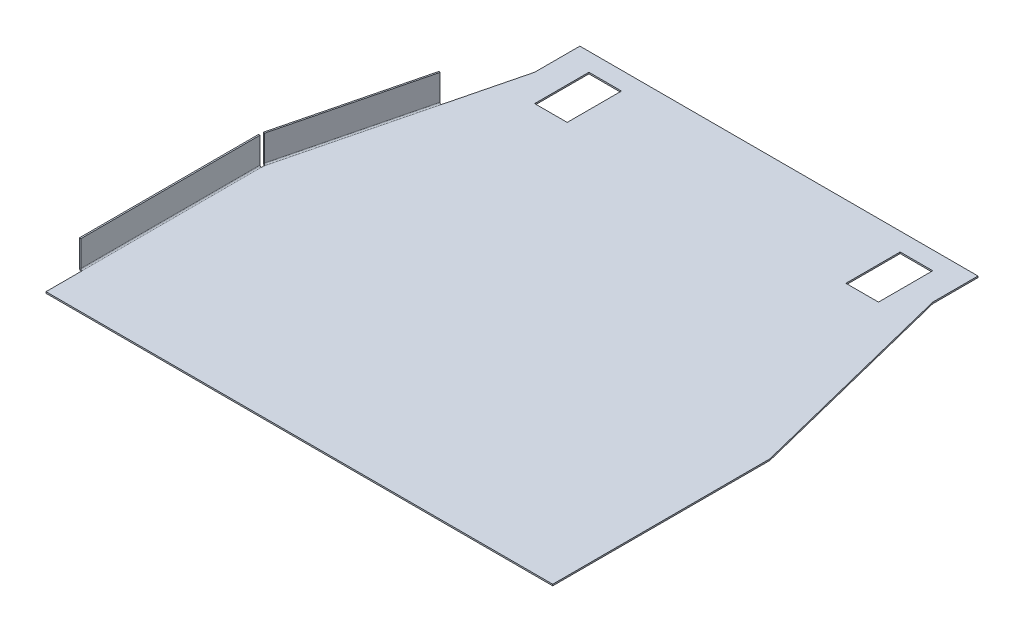
ISO-10303-21;
HEADER;
FILE_DESCRIPTION(('STEP AP214'),'2;1');
FILE_NAME('part.step','',(''),(''),'','','');
FILE_SCHEMA(('AUTOMOTIVE_DESIGN { 1 0 10303 214 1 1 1 1 }'));
ENDSEC;
DATA;
#1=APPLICATION_CONTEXT('core data for automotive mechanical design processes');
#2=APPLICATION_PROTOCOL_DEFINITION('international standard','automotive_design',2000,#1);
#3=PRODUCT_CONTEXT('',#1,'mechanical');
#4=PRODUCT('Part','Part','',(#3));
#5=PRODUCT_RELATED_PRODUCT_CATEGORY('part','',(#4));
#6=PRODUCT_DEFINITION_FORMATION('','',#4);
#7=PRODUCT_DEFINITION_CONTEXT('part definition',#1,'design');
#8=PRODUCT_DEFINITION('design','',#6,#7);
#9=PRODUCT_DEFINITION_SHAPE('','',#8);
#10=(LENGTH_UNIT() NAMED_UNIT(*) SI_UNIT(.MILLI.,.METRE.));
#11=(NAMED_UNIT(*) PLANE_ANGLE_UNIT() SI_UNIT($,.RADIAN.));
#12=(NAMED_UNIT(*) SI_UNIT($,.STERADIAN.) SOLID_ANGLE_UNIT());
#13=UNCERTAINTY_MEASURE_WITH_UNIT(LENGTH_MEASURE(1.E-05),#10,'distance_accuracy_value','');
#14=(GEOMETRIC_REPRESENTATION_CONTEXT(3) GLOBAL_UNCERTAINTY_ASSIGNED_CONTEXT((#13)) GLOBAL_UNIT_ASSIGNED_CONTEXT((#10,
#11,#12)) REPRESENTATION_CONTEXT('',''));
#15=CARTESIAN_POINT('',(0.,0.,0.));
#16=DIRECTION('',(0.,0.,1.));
#17=DIRECTION('',(1.,0.,0.));
#18=AXIS2_PLACEMENT_3D('',#15,#16,#17);
#19=CARTESIAN_POINT('',(-140.,-0.8,-60.));
#20=DIRECTION('',(-0.970142500145332,0.,-0.242535625036333));
#21=DIRECTION('',(-0.242535625036333,0.,0.970142500145332));
#22=AXIS2_PLACEMENT_3D('',#19,#20,#21);
#23=PLANE('',#22);
#24=DIRECTION('',(-0.242535625036333,0.,0.970142500145332));
#25=VECTOR('',#24,1.);
#26=CARTESIAN_POINT('',(-140.,0.,-60.));
#27=LINE('',#26,#25);
#28=CARTESIAN_POINT('',(-139.757464374964,-3.89553840574042E-13,-60.9701425001453));
#29=VERTEX_POINT('',#28);
#30=CARTESIAN_POINT('',(-140.,0.,-60.));
#31=VERTEX_POINT('',#30);
#32=EDGE_CURVE('E365',#29,#31,#27,.T.);
#33=ORIENTED_EDGE('',*,*,#32,.F.);
#34=DIRECTION('',(5.275292677418E-13,-1.,1.31882316935456E-13));
#35=VECTOR('',#34,1.);
#36=CARTESIAN_POINT('',(-139.757464374964,-3.89553840574042E-13,-60.9701425001453));
#37=LINE('',#36,#35);
#38=CARTESIAN_POINT('',(-139.757464374964,-0.8,-60.9701425001453));
#39=VERTEX_POINT('',#38);
#40=EDGE_CURVE('E311',#29,#39,#37,.T.);
#41=ORIENTED_EDGE('',*,*,#40,.T.);
#42=DIRECTION('',(-0.242535625036333,0.,0.970142500145332));
#43=VECTOR('',#42,1.);
#44=CARTESIAN_POINT('',(-140.,-0.8,-60.));
#45=LINE('',#44,#43);
#46=CARTESIAN_POINT('',(-140.,-0.8,-60.));
#47=VERTEX_POINT('',#46);
#48=EDGE_CURVE('E543',#39,#47,#45,.T.);
#49=ORIENTED_EDGE('',*,*,#48,.T.);
#50=DIRECTION('',(0.,1.,0.));
#51=VECTOR('',#50,1.);
#52=CARTESIAN_POINT('',(-140.,-0.8,-60.));
#53=LINE('',#52,#51);
#54=EDGE_CURVE('E418',#47,#31,#53,.T.);
#55=ORIENTED_EDGE('',*,*,#54,.T.);
#56=EDGE_LOOP('',(#33,#41,#49,#55));
#57=FACE_BOUND('',#56,.T.);
#58=ADVANCED_FACE('F75',(#57),#23,.T.);
#59=CARTESIAN_POINT('',(-140.,-0.8,-60.));
#60=DIRECTION('',(-1.,0.,0.));
#61=DIRECTION('',(0.,0.,1.));
#62=AXIS2_PLACEMENT_3D('',#59,#60,#61);
#63=PLANE('',#62);
#64=DIRECTION('',(0.,0.,1.));
#65=VECTOR('',#64,1.);
#66=CARTESIAN_POINT('',(-140.,0.,-60.));
#67=LINE('',#66,#65);
#68=CARTESIAN_POINT('',(-140.,0.,40.));
#69=VERTEX_POINT('',#68);
#70=CARTESIAN_POINT('',(-140.,0.,60.));
#71=VERTEX_POINT('',#70);
#72=EDGE_CURVE('E406',#69,#71,#67,.T.);
#73=ORIENTED_EDGE('',*,*,#72,.F.);
#74=DIRECTION('',(0.,-1.,0.));
#75=VECTOR('',#74,1.);
#76=CARTESIAN_POINT('',(-140.,0.,40.));
#77=LINE('',#76,#75);
#78=CARTESIAN_POINT('',(-140.,-0.8,40.));
#79=VERTEX_POINT('',#78);
#80=EDGE_CURVE('E450',#69,#79,#77,.T.);
#81=ORIENTED_EDGE('',*,*,#80,.T.);
#82=DIRECTION('',(0.,0.,1.));
#83=VECTOR('',#82,1.);
#84=CARTESIAN_POINT('',(-140.,-0.8,-60.));
#85=LINE('',#84,#83);
#86=CARTESIAN_POINT('',(-140.,-0.8,60.));
#87=VERTEX_POINT('',#86);
#88=EDGE_CURVE('E393',#79,#87,#85,.T.);
#89=ORIENTED_EDGE('',*,*,#88,.T.);
#90=DIRECTION('',(0.,1.,0.));
#91=VECTOR('',#90,1.);
#92=CARTESIAN_POINT('',(-140.,-0.8,60.));
#93=LINE('',#92,#91);
#94=EDGE_CURVE('E84',#87,#71,#93,.T.);
#95=ORIENTED_EDGE('',*,*,#94,.T.);
#96=EDGE_LOOP('',(#73,#81,#89,#95));
#97=FACE_BOUND('',#96,.T.);
#98=ADVANCED_FACE('F449',(#97),#63,.T.);
#99=CARTESIAN_POINT('',(140.,-0.8,-60.));
#100=DIRECTION('',(1.,0.,0.));
#101=DIRECTION('',(0.,0.,-1.));
#102=AXIS2_PLACEMENT_3D('',#99,#100,#101);
#103=PLANE('',#102);
#104=DIRECTION('',(0.,0.,-1.));
#105=VECTOR('',#104,1.);
#106=CARTESIAN_POINT('',(140.,0.,-60.));
#107=LINE('',#106,#105);
#108=CARTESIAN_POINT('',(140.,0.,60.));
#109=VERTEX_POINT('',#108);
#110=CARTESIAN_POINT('',(140.,0.,-60.));
#111=VERTEX_POINT('',#110);
#112=EDGE_CURVE('E383',#109,#111,#107,.T.);
#113=ORIENTED_EDGE('',*,*,#112,.F.);
#114=DIRECTION('',(0.,1.,0.));
#115=VECTOR('',#114,1.);
#116=CARTESIAN_POINT('',(140.,-0.8,60.));
#117=LINE('',#116,#115);
#118=CARTESIAN_POINT('',(140.,-0.8,60.));
#119=VERTEX_POINT('',#118);
#120=EDGE_CURVE('E13',#119,#109,#117,.T.);
#121=ORIENTED_EDGE('',*,*,#120,.F.);
#122=DIRECTION('',(0.,0.,-1.));
#123=VECTOR('',#122,1.);
#124=CARTESIAN_POINT('',(140.,-0.8,-60.));
#125=LINE('',#124,#123);
#126=CARTESIAN_POINT('',(140.,-0.8,-60.));
#127=VERTEX_POINT('',#126);
#128=EDGE_CURVE('E391',#119,#127,#125,.T.);
#129=ORIENTED_EDGE('',*,*,#128,.T.);
#130=DIRECTION('',(0.,1.,0.));
#131=VECTOR('',#130,1.);
#132=CARTESIAN_POINT('',(140.,-0.8,-60.));
#133=LINE('',#132,#131);
#134=EDGE_CURVE('E420',#127,#111,#133,.T.);
#135=ORIENTED_EDGE('',*,*,#134,.T.);
#136=EDGE_LOOP('',(#113,#121,#129,#135));
#137=FACE_BOUND('',#136,.T.);
#138=ADVANCED_FACE('F77',(#137),#103,.T.);
#139=CARTESIAN_POINT('',(-140.,-0.8,60.));
#140=DIRECTION('',(0.,0.,1.));
#141=DIRECTION('',(1.,0.,0.));
#142=AXIS2_PLACEMENT_3D('',#139,#140,#141);
#143=PLANE('',#142);
#144=DIRECTION('',(1.,0.,0.));
#145=VECTOR('',#144,1.);
#146=CARTESIAN_POINT('',(-140.,0.,60.));
#147=LINE('',#146,#145);
#148=EDGE_CURVE('E394',#71,#109,#147,.T.);
#149=ORIENTED_EDGE('',*,*,#148,.F.);
#150=ORIENTED_EDGE('',*,*,#94,.F.);
#151=DIRECTION('',(1.,0.,0.));
#152=VECTOR('',#151,1.);
#153=CARTESIAN_POINT('',(-140.,-0.8,60.));
#154=LINE('',#153,#152);
#155=EDGE_CURVE('E397',#87,#119,#154,.T.);
#156=ORIENTED_EDGE('',*,*,#155,.T.);
#157=ORIENTED_EDGE('',*,*,#120,.T.);
#158=EDGE_LOOP('',(#149,#150,#156,#157));
#159=FACE_BOUND('',#158,.T.);
#160=ADVANCED_FACE('F429',(#159),#143,.T.);
#161=DIRECTION('',(0.,-1.,0.));
#162=VECTOR('',#161,1.);
#163=CARTESIAN_POINT('',(-140.,0.,-59.));
#164=LINE('',#163,#162);
#165=CARTESIAN_POINT('',(-140.,0.,-59.));
#166=VERTEX_POINT('',#165);
#167=CARTESIAN_POINT('',(-140.,-0.799999999999997,-59.));
#168=VERTEX_POINT('',#167);
#169=EDGE_CURVE('E453',#166,#168,#164,.T.);
#170=ORIENTED_EDGE('',*,*,#169,.F.);
#171=EDGE_CURVE('E409',#31,#166,#67,.T.);
#172=ORIENTED_EDGE('',*,*,#171,.F.);
#173=ORIENTED_EDGE('',*,*,#54,.F.);
#174=EDGE_CURVE('E403',#47,#168,#85,.T.);
#175=ORIENTED_EDGE('',*,*,#174,.T.);
#176=EDGE_LOOP('',(#170,#172,#173,#175));
#177=FACE_BOUND('',#176,.T.);
#178=ADVANCED_FACE('F555',(#177),#63,.T.);
#179=CARTESIAN_POINT('',(0.,-0.8,0.));
#180=DIRECTION('',(0.,1.,0.));
#181=DIRECTION('',(0.,0.,1.));
#182=AXIS2_PLACEMENT_3D('',#179,#180,#181);
#183=PLANE('',#182);
#184=DIRECTION('',(1.,0.,0.));
#185=VECTOR('',#184,1.);
#186=CARTESIAN_POINT('',(95.,-0.8,-165.));
#187=LINE('',#186,#185);
#188=CARTESIAN_POINT('',(77.,-0.8,-165.));
#189=VERTEX_POINT('',#188);
#190=CARTESIAN_POINT('',(95.,-0.8,-165.));
#191=VERTEX_POINT('',#190);
#192=EDGE_CURVE('E482',#189,#191,#187,.T.);
#193=ORIENTED_EDGE('',*,*,#192,.T.);
#194=DIRECTION('',(0.,0.,-1.));
#195=VECTOR('',#194,1.);
#196=CARTESIAN_POINT('',(95.,-0.8,-165.));
#197=LINE('',#196,#195);
#198=CARTESIAN_POINT('',(95.,-0.8,-195.));
#199=VERTEX_POINT('',#198);
#200=EDGE_CURVE('E472',#191,#199,#197,.T.);
#201=ORIENTED_EDGE('',*,*,#200,.T.);
#202=DIRECTION('',(-1.,0.,0.));
#203=VECTOR('',#202,1.);
#204=CARTESIAN_POINT('',(95.,-0.8,-195.));
#205=LINE('',#204,#203);
#206=CARTESIAN_POINT('',(77.,-0.8,-195.));
#207=VERTEX_POINT('',#206);
#208=EDGE_CURVE('E475',#199,#207,#205,.T.);
#209=ORIENTED_EDGE('',*,*,#208,.T.);
#210=DIRECTION('',(0.,0.,1.));
#211=VECTOR('',#210,1.);
#212=CARTESIAN_POINT('',(77.,-0.8,-165.));
#213=LINE('',#212,#211);
#214=EDGE_CURVE('E479',#207,#189,#213,.T.);
#215=ORIENTED_EDGE('',*,*,#214,.T.);
#216=EDGE_LOOP('',(#193,#201,#209,#215));
#217=FACE_BOUND('',#216,.T.);
#218=DIRECTION('',(1.,0.,0.));
#219=VECTOR('',#218,1.);
#220=CARTESIAN_POINT('',(-95.,-0.8,-165.));
#221=LINE('',#220,#219);
#222=CARTESIAN_POINT('',(-95.,-0.8,-165.));
#223=VERTEX_POINT('',#222);
#224=CARTESIAN_POINT('',(-77.,-0.8,-165.));
#225=VERTEX_POINT('',#224);
#226=EDGE_CURVE('E514',#223,#225,#221,.T.);
#227=ORIENTED_EDGE('',*,*,#226,.T.);
#228=DIRECTION('',(0.,0.,-1.));
#229=VECTOR('',#228,1.);
#230=CARTESIAN_POINT('',(-77.,-0.8,-165.));
#231=LINE('',#230,#229);
#232=CARTESIAN_POINT('',(-77.,-0.8,-195.));
#233=VERTEX_POINT('',#232);
#234=EDGE_CURVE('E504',#225,#233,#231,.T.);
#235=ORIENTED_EDGE('',*,*,#234,.T.);
#236=DIRECTION('',(-1.,0.,0.));
#237=VECTOR('',#236,1.);
#238=CARTESIAN_POINT('',(-95.,-0.8,-195.));
#239=LINE('',#238,#237);
#240=CARTESIAN_POINT('',(-95.,-0.8,-195.));
#241=VERTEX_POINT('',#240);
#242=EDGE_CURVE('E507',#233,#241,#239,.T.);
#243=ORIENTED_EDGE('',*,*,#242,.T.);
#244=DIRECTION('',(0.,0.,1.));
#245=VECTOR('',#244,1.);
#246=CARTESIAN_POINT('',(-95.,-0.8,-165.));
#247=LINE('',#246,#245);
#248=EDGE_CURVE('E511',#241,#223,#247,.T.);
#249=ORIENTED_EDGE('',*,*,#248,.T.);
#250=EDGE_LOOP('',(#227,#235,#243,#249));
#251=FACE_BOUND('',#250,.T.);
#252=ORIENTED_EDGE('',*,*,#128,.F.);
#253=ORIENTED_EDGE('',*,*,#155,.F.);
#254=ORIENTED_EDGE('',*,*,#88,.F.);
#255=DIRECTION('',(0.,0.,1.));
#256=VECTOR('',#255,1.);
#257=CARTESIAN_POINT('',(-140.,-0.799999999999997,40.));
#258=LINE('',#257,#256);
#259=EDGE_CURVE('E459',#79,#168,#258,.F.);
#260=ORIENTED_EDGE('',*,*,#259,.T.);
#261=ORIENTED_EDGE('',*,*,#174,.F.);
#262=ORIENTED_EDGE('',*,*,#48,.F.);
#263=DIRECTION('',(-0.242535625036343,0.,0.970142500145329));
#264=VECTOR('',#263,1.);
#265=CARTESIAN_POINT('',(-139.757464374963,-0.80000000000039,-60.9701425001452));
#266=LINE('',#265,#264);
#267=CARTESIAN_POINT('',(-120.354614372056,-0.80000000000039,-138.581542511772));
#268=VERTEX_POINT('',#267);
#269=EDGE_CURVE('E321',#39,#268,#266,.F.);
#270=ORIENTED_EDGE('',*,*,#269,.T.);
#271=CARTESIAN_POINT('',(-110.,-0.8,-180.));
#272=VERTEX_POINT('',#271);
#273=EDGE_CURVE('E358',#272,#268,#45,.T.);
#274=ORIENTED_EDGE('',*,*,#273,.F.);
#275=DIRECTION('',(0.,0.,1.));
#276=VECTOR('',#275,1.);
#277=CARTESIAN_POINT('',(-110.,-0.8,-180.));
#278=LINE('',#277,#276);
#279=CARTESIAN_POINT('',(-110.,-0.8,-205.));
#280=VERTEX_POINT('',#279);
#281=EDGE_CURVE('E540',#280,#272,#278,.T.);
#282=ORIENTED_EDGE('',*,*,#281,.F.);
#283=DIRECTION('',(-1.,0.,0.));
#284=VECTOR('',#283,1.);
#285=CARTESIAN_POINT('',(-110.,-0.8,-205.));
#286=LINE('',#285,#284);
#287=CARTESIAN_POINT('',(110.,-0.8,-205.));
#288=VERTEX_POINT('',#287);
#289=EDGE_CURVE('E537',#288,#280,#286,.T.);
#290=ORIENTED_EDGE('',*,*,#289,.F.);
#291=DIRECTION('',(0.,0.,-1.));
#292=VECTOR('',#291,1.);
#293=CARTESIAN_POINT('',(110.,-0.8,-180.));
#294=LINE('',#293,#292);
#295=CARTESIAN_POINT('',(110.,-0.8,-180.));
#296=VERTEX_POINT('',#295);
#297=EDGE_CURVE('E368',#296,#288,#294,.T.);
#298=ORIENTED_EDGE('',*,*,#297,.F.);
#299=DIRECTION('',(-0.242535625036333,0.,-0.970142500145332));
#300=VECTOR('',#299,1.);
#301=CARTESIAN_POINT('',(140.,-0.8,-60.));
#302=LINE('',#301,#300);
#303=EDGE_CURVE('E390',#127,#296,#302,.T.);
#304=ORIENTED_EDGE('',*,*,#303,.F.);
#305=EDGE_LOOP('',(#252,#253,#254,#260,#261,#262,#270,#274,#282,#290,#298,#304));
#306=FACE_BOUND('',#305,.T.);
#307=ADVANCED_FACE('F432',(#217,#251,#306),#183,.F.);
#308=CARTESIAN_POINT('',(0.,0.,0.));
#309=DIRECTION('',(0.,1.,0.));
#310=DIRECTION('',(0.,0.,1.));
#311=AXIS2_PLACEMENT_3D('',#308,#309,#310);
#312=PLANE('',#311);
#313=DIRECTION('',(0.,0.,-1.));
#314=VECTOR('',#313,1.);
#315=CARTESIAN_POINT('',(95.,0.,-165.));
#316=LINE('',#315,#314);
#317=CARTESIAN_POINT('',(95.,0.,-165.));
#318=VERTEX_POINT('',#317);
#319=CARTESIAN_POINT('',(95.,0.,-195.));
#320=VERTEX_POINT('',#319);
#321=EDGE_CURVE('E456',#318,#320,#316,.T.);
#322=ORIENTED_EDGE('',*,*,#321,.F.);
#323=DIRECTION('',(1.,0.,0.));
#324=VECTOR('',#323,1.);
#325=CARTESIAN_POINT('',(95.,0.,-165.));
#326=LINE('',#325,#324);
#327=CARTESIAN_POINT('',(77.,0.,-165.));
#328=VERTEX_POINT('',#327);
#329=EDGE_CURVE('E476',#328,#318,#326,.T.);
#330=ORIENTED_EDGE('',*,*,#329,.F.);
#331=DIRECTION('',(0.,0.,1.));
#332=VECTOR('',#331,1.);
#333=CARTESIAN_POINT('',(77.,0.,-165.));
#334=LINE('',#333,#332);
#335=CARTESIAN_POINT('',(77.,0.,-195.));
#336=VERTEX_POINT('',#335);
#337=EDGE_CURVE('E490',#336,#328,#334,.T.);
#338=ORIENTED_EDGE('',*,*,#337,.F.);
#339=DIRECTION('',(-1.,0.,0.));
#340=VECTOR('',#339,1.);
#341=CARTESIAN_POINT('',(95.,0.,-195.));
#342=LINE('',#341,#340);
#343=EDGE_CURVE('E487',#320,#336,#342,.T.);
#344=ORIENTED_EDGE('',*,*,#343,.F.);
#345=EDGE_LOOP('',(#322,#330,#338,#344));
#346=FACE_BOUND('',#345,.T.);
#347=DIRECTION('',(0.,0.,-1.));
#348=VECTOR('',#347,1.);
#349=CARTESIAN_POINT('',(-77.,0.,-165.));
#350=LINE('',#349,#348);
#351=CARTESIAN_POINT('',(-77.,0.,-165.));
#352=VERTEX_POINT('',#351);
#353=CARTESIAN_POINT('',(-77.,0.,-195.));
#354=VERTEX_POINT('',#353);
#355=EDGE_CURVE('E497',#352,#354,#350,.T.);
#356=ORIENTED_EDGE('',*,*,#355,.F.);
#357=DIRECTION('',(1.,0.,0.));
#358=VECTOR('',#357,1.);
#359=CARTESIAN_POINT('',(-95.,0.,-165.));
#360=LINE('',#359,#358);
#361=CARTESIAN_POINT('',(-95.,0.,-165.));
#362=VERTEX_POINT('',#361);
#363=EDGE_CURVE('E508',#362,#352,#360,.T.);
#364=ORIENTED_EDGE('',*,*,#363,.F.);
#365=DIRECTION('',(0.,0.,1.));
#366=VECTOR('',#365,1.);
#367=CARTESIAN_POINT('',(-95.,0.,-165.));
#368=LINE('',#367,#366);
#369=CARTESIAN_POINT('',(-95.,0.,-195.));
#370=VERTEX_POINT('',#369);
#371=EDGE_CURVE('E522',#370,#362,#368,.T.);
#372=ORIENTED_EDGE('',*,*,#371,.F.);
#373=DIRECTION('',(-1.,0.,0.));
#374=VECTOR('',#373,1.);
#375=CARTESIAN_POINT('',(-95.,0.,-195.));
#376=LINE('',#375,#374);
#377=EDGE_CURVE('E519',#354,#370,#376,.T.);
#378=ORIENTED_EDGE('',*,*,#377,.F.);
#379=EDGE_LOOP('',(#356,#364,#372,#378));
#380=FACE_BOUND('',#379,.T.);
#381=ORIENTED_EDGE('',*,*,#112,.T.);
#382=DIRECTION('',(-0.242535625036333,0.,-0.970142500145332));
#383=VECTOR('',#382,1.);
#384=CARTESIAN_POINT('',(140.,0.,-60.));
#385=LINE('',#384,#383);
#386=CARTESIAN_POINT('',(110.,0.,-180.));
#387=VERTEX_POINT('',#386);
#388=EDGE_CURVE('E364',#111,#387,#385,.T.);
#389=ORIENTED_EDGE('',*,*,#388,.T.);
#390=DIRECTION('',(0.,0.,-1.));
#391=VECTOR('',#390,1.);
#392=CARTESIAN_POINT('',(110.,0.,-180.));
#393=LINE('',#392,#391);
#394=CARTESIAN_POINT('',(110.,0.,-205.));
#395=VERTEX_POINT('',#394);
#396=EDGE_CURVE('E442',#387,#395,#393,.T.);
#397=ORIENTED_EDGE('',*,*,#396,.T.);
#398=DIRECTION('',(-1.,0.,0.));
#399=VECTOR('',#398,1.);
#400=CARTESIAN_POINT('',(-110.,0.,-205.));
#401=LINE('',#400,#399);
#402=CARTESIAN_POINT('',(-110.,0.,-205.));
#403=VERTEX_POINT('',#402);
#404=EDGE_CURVE('E1039',#395,#403,#401,.T.);
#405=ORIENTED_EDGE('',*,*,#404,.T.);
#406=DIRECTION('',(0.,0.,1.));
#407=VECTOR('',#406,1.);
#408=CARTESIAN_POINT('',(-110.,0.,-180.));
#409=LINE('',#408,#407);
#410=CARTESIAN_POINT('',(-110.,0.,-180.));
#411=VERTEX_POINT('',#410);
#412=EDGE_CURVE('E363',#403,#411,#409,.T.);
#413=ORIENTED_EDGE('',*,*,#412,.T.);
#414=CARTESIAN_POINT('',(-120.354614372056,-3.89553840574042E-13,-138.581542511772));
#415=VERTEX_POINT('',#414);
#416=EDGE_CURVE('E356',#411,#415,#27,.T.);
#417=ORIENTED_EDGE('',*,*,#416,.T.);
#418=DIRECTION('',(-0.242535625036343,0.,0.970142500145329));
#419=VECTOR('',#418,1.);
#420=CARTESIAN_POINT('',(-139.757464374964,-3.89553840574042E-13,-60.9701425001453));
#421=LINE('',#420,#419);
#422=EDGE_CURVE('E317',#29,#415,#421,.F.);
#423=ORIENTED_EDGE('',*,*,#422,.F.);
#424=ORIENTED_EDGE('',*,*,#32,.T.);
#425=ORIENTED_EDGE('',*,*,#171,.T.);
#426=DIRECTION('',(0.,0.,1.));
#427=VECTOR('',#426,1.);
#428=CARTESIAN_POINT('',(-140.,0.,40.));
#429=LINE('',#428,#427);
#430=EDGE_CURVE('E446',#69,#166,#429,.F.);
#431=ORIENTED_EDGE('',*,*,#430,.F.);
#432=ORIENTED_EDGE('',*,*,#72,.T.);
#433=ORIENTED_EDGE('',*,*,#148,.T.);
#434=EDGE_LOOP('',(#381,#389,#397,#405,#413,#417,#423,#424,#425,#431,#432,#433));
#435=FACE_BOUND('',#434,.T.);
#436=ADVANCED_FACE('F360',(#346,#380,#435),#312,.T.);
#437=CARTESIAN_POINT('',(110.,-0.8,-180.));
#438=DIRECTION('',(1.,0.,0.));
#439=DIRECTION('',(0.,0.,-1.));
#440=AXIS2_PLACEMENT_3D('',#437,#438,#439);
#441=PLANE('',#440);
#442=ORIENTED_EDGE('',*,*,#396,.F.);
#443=DIRECTION('',(0.,1.,0.));
#444=VECTOR('',#443,1.);
#445=CARTESIAN_POINT('',(110.,-0.8,-180.));
#446=LINE('',#445,#444);
#447=EDGE_CURVE('E381',#296,#387,#446,.T.);
#448=ORIENTED_EDGE('',*,*,#447,.F.);
#449=ORIENTED_EDGE('',*,*,#297,.T.);
#450=DIRECTION('',(0.,1.,0.));
#451=VECTOR('',#450,1.);
#452=CARTESIAN_POINT('',(110.,-0.8,-205.));
#453=LINE('',#452,#451);
#454=EDGE_CURVE('E388',#288,#395,#453,.T.);
#455=ORIENTED_EDGE('',*,*,#454,.T.);
#456=EDGE_LOOP('',(#442,#448,#449,#455));
#457=FACE_BOUND('',#456,.T.);
#458=ADVANCED_FACE('F645',(#457),#441,.T.);
#459=CARTESIAN_POINT('',(140.,-0.8,-60.));
#460=DIRECTION('',(0.970142500145332,0.,-0.242535625036333));
#461=DIRECTION('',(-0.242535625036333,0.,-0.970142500145332));
#462=AXIS2_PLACEMENT_3D('',#459,#460,#461);
#463=PLANE('',#462);
#464=ORIENTED_EDGE('',*,*,#388,.F.);
#465=ORIENTED_EDGE('',*,*,#134,.F.);
#466=ORIENTED_EDGE('',*,*,#303,.T.);
#467=ORIENTED_EDGE('',*,*,#447,.T.);
#468=EDGE_LOOP('',(#464,#465,#466,#467));
#469=FACE_BOUND('',#468,.T.);
#470=ADVANCED_FACE('F439',(#469),#463,.T.);
#471=DIRECTION('',(5.32239350489496E-13,-1.,1.3188231693545E-13));
#472=VECTOR('',#471,1.);
#473=CARTESIAN_POINT('',(-120.354614372056,-3.89553840574042E-13,-138.581542511772));
#474=LINE('',#473,#472);
#475=EDGE_CURVE('E307',#415,#268,#474,.T.);
#476=ORIENTED_EDGE('',*,*,#475,.F.);
#477=ORIENTED_EDGE('',*,*,#416,.F.);
#478=DIRECTION('',(0.,1.,0.));
#479=VECTOR('',#478,1.);
#480=CARTESIAN_POINT('',(-110.,-0.8,-180.));
#481=LINE('',#480,#479);
#482=EDGE_CURVE('E384',#272,#411,#481,.T.);
#483=ORIENTED_EDGE('',*,*,#482,.F.);
#484=ORIENTED_EDGE('',*,*,#273,.T.);
#485=EDGE_LOOP('',(#476,#477,#483,#484));
#486=FACE_BOUND('',#485,.T.);
#487=ADVANCED_FACE('F355',(#486),#23,.T.);
#488=CARTESIAN_POINT('',(-110.,-0.8,-180.));
#489=DIRECTION('',(-1.,0.,0.));
#490=DIRECTION('',(0.,0.,1.));
#491=AXIS2_PLACEMENT_3D('',#488,#489,#490);
#492=PLANE('',#491);
#493=ORIENTED_EDGE('',*,*,#412,.F.);
#494=DIRECTION('',(0.,1.,0.));
#495=VECTOR('',#494,1.);
#496=CARTESIAN_POINT('',(-110.,-0.8,-205.));
#497=LINE('',#496,#495);
#498=EDGE_CURVE('E386',#280,#403,#497,.T.);
#499=ORIENTED_EDGE('',*,*,#498,.F.);
#500=ORIENTED_EDGE('',*,*,#281,.T.);
#501=ORIENTED_EDGE('',*,*,#482,.T.);
#502=EDGE_LOOP('',(#493,#499,#500,#501));
#503=FACE_BOUND('',#502,.T.);
#504=ADVANCED_FACE('F638',(#503),#492,.T.);
#505=CARTESIAN_POINT('',(-110.,-0.8,-205.));
#506=DIRECTION('',(0.,0.,-1.));
#507=DIRECTION('',(-1.,0.,0.));
#508=AXIS2_PLACEMENT_3D('',#505,#506,#507);
#509=PLANE('',#508);
#510=ORIENTED_EDGE('',*,*,#404,.F.);
#511=ORIENTED_EDGE('',*,*,#454,.F.);
#512=ORIENTED_EDGE('',*,*,#289,.T.);
#513=ORIENTED_EDGE('',*,*,#498,.T.);
#514=EDGE_LOOP('',(#510,#511,#512,#513));
#515=FACE_BOUND('',#514,.T.);
#516=ADVANCED_FACE('F643',(#515),#509,.T.);
#517=CARTESIAN_POINT('',(-77.,-0.8,-165.));
#518=DIRECTION('',(1.,0.,0.));
#519=DIRECTION('',(0.,0.,-1.));
#520=AXIS2_PLACEMENT_3D('',#517,#518,#519);
#521=PLANE('',#520);
#522=ORIENTED_EDGE('',*,*,#355,.T.);
#523=DIRECTION('',(0.,1.,0.));
#524=VECTOR('',#523,1.);
#525=CARTESIAN_POINT('',(-77.,-0.8,-195.));
#526=LINE('',#525,#524);
#527=EDGE_CURVE('E517',#233,#354,#526,.T.);
#528=ORIENTED_EDGE('',*,*,#527,.F.);
#529=ORIENTED_EDGE('',*,*,#234,.F.);
#530=DIRECTION('',(0.,1.,0.));
#531=VECTOR('',#530,1.);
#532=CARTESIAN_POINT('',(-77.,-0.8,-165.));
#533=LINE('',#532,#531);
#534=EDGE_CURVE('E527',#225,#352,#533,.T.);
#535=ORIENTED_EDGE('',*,*,#534,.T.);
#536=EDGE_LOOP('',(#522,#528,#529,#535));
#537=FACE_BOUND('',#536,.T.);
#538=ADVANCED_FACE('F652',(#537),#521,.F.);
#539=CARTESIAN_POINT('',(-95.,-0.8,-165.));
#540=DIRECTION('',(0.,0.,1.));
#541=DIRECTION('',(1.,0.,0.));
#542=AXIS2_PLACEMENT_3D('',#539,#540,#541);
#543=PLANE('',#542);
#544=ORIENTED_EDGE('',*,*,#363,.T.);
#545=ORIENTED_EDGE('',*,*,#534,.F.);
#546=ORIENTED_EDGE('',*,*,#226,.F.);
#547=DIRECTION('',(0.,1.,0.));
#548=VECTOR('',#547,1.);
#549=CARTESIAN_POINT('',(-95.,-0.8,-165.));
#550=LINE('',#549,#548);
#551=EDGE_CURVE('E529',#223,#362,#550,.T.);
#552=ORIENTED_EDGE('',*,*,#551,.T.);
#553=EDGE_LOOP('',(#544,#545,#546,#552));
#554=FACE_BOUND('',#553,.T.);
#555=ADVANCED_FACE('F655',(#554),#543,.F.);
#556=CARTESIAN_POINT('',(-95.,-0.8,-165.));
#557=DIRECTION('',(-1.,0.,0.));
#558=DIRECTION('',(0.,0.,1.));
#559=AXIS2_PLACEMENT_3D('',#556,#557,#558);
#560=PLANE('',#559);
#561=ORIENTED_EDGE('',*,*,#371,.T.);
#562=ORIENTED_EDGE('',*,*,#551,.F.);
#563=ORIENTED_EDGE('',*,*,#248,.F.);
#564=DIRECTION('',(0.,1.,0.));
#565=VECTOR('',#564,1.);
#566=CARTESIAN_POINT('',(-95.,-0.8,-195.));
#567=LINE('',#566,#565);
#568=EDGE_CURVE('E531',#241,#370,#567,.T.);
#569=ORIENTED_EDGE('',*,*,#568,.T.);
#570=EDGE_LOOP('',(#561,#562,#563,#569));
#571=FACE_BOUND('',#570,.T.);
#572=ADVANCED_FACE('F661',(#571),#560,.F.);
#573=CARTESIAN_POINT('',(-95.,-0.8,-195.));
#574=DIRECTION('',(0.,0.,-1.));
#575=DIRECTION('',(-1.,0.,0.));
#576=AXIS2_PLACEMENT_3D('',#573,#574,#575);
#577=PLANE('',#576);
#578=ORIENTED_EDGE('',*,*,#377,.T.);
#579=ORIENTED_EDGE('',*,*,#568,.F.);
#580=ORIENTED_EDGE('',*,*,#242,.F.);
#581=ORIENTED_EDGE('',*,*,#527,.T.);
#582=EDGE_LOOP('',(#578,#579,#580,#581));
#583=FACE_BOUND('',#582,.T.);
#584=ADVANCED_FACE('F657',(#583),#577,.F.);
#585=CARTESIAN_POINT('',(95.,-0.8,-165.));
#586=DIRECTION('',(1.,0.,0.));
#587=DIRECTION('',(0.,0.,-1.));
#588=AXIS2_PLACEMENT_3D('',#585,#586,#587);
#589=PLANE('',#588);
#590=ORIENTED_EDGE('',*,*,#321,.T.);
#591=DIRECTION('',(0.,1.,0.));
#592=VECTOR('',#591,1.);
#593=CARTESIAN_POINT('',(95.,-0.8,-195.));
#594=LINE('',#593,#592);
#595=EDGE_CURVE('E485',#199,#320,#594,.T.);
#596=ORIENTED_EDGE('',*,*,#595,.F.);
#597=ORIENTED_EDGE('',*,*,#200,.F.);
#598=DIRECTION('',(0.,1.,0.));
#599=VECTOR('',#598,1.);
#600=CARTESIAN_POINT('',(95.,-0.8,-165.));
#601=LINE('',#600,#599);
#602=EDGE_CURVE('E495',#191,#318,#601,.T.);
#603=ORIENTED_EDGE('',*,*,#602,.T.);
#604=EDGE_LOOP('',(#590,#596,#597,#603));
#605=FACE_BOUND('',#604,.T.);
#606=ADVANCED_FACE('F660',(#605),#589,.F.);
#607=CARTESIAN_POINT('',(95.,-0.8,-165.));
#608=DIRECTION('',(0.,0.,1.));
#609=DIRECTION('',(1.,0.,0.));
#610=AXIS2_PLACEMENT_3D('',#607,#608,#609);
#611=PLANE('',#610);
#612=ORIENTED_EDGE('',*,*,#329,.T.);
#613=ORIENTED_EDGE('',*,*,#602,.F.);
#614=ORIENTED_EDGE('',*,*,#192,.F.);
#615=DIRECTION('',(0.,1.,0.));
#616=VECTOR('',#615,1.);
#617=CARTESIAN_POINT('',(77.,-0.8,-165.));
#618=LINE('',#617,#616);
#619=EDGE_CURVE('E498',#189,#328,#618,.T.);
#620=ORIENTED_EDGE('',*,*,#619,.T.);
#621=EDGE_LOOP('',(#612,#613,#614,#620));
#622=FACE_BOUND('',#621,.T.);
#623=ADVANCED_FACE('F671',(#622),#611,.F.);
#624=CARTESIAN_POINT('',(77.,-0.8,-165.));
#625=DIRECTION('',(-1.,0.,0.));
#626=DIRECTION('',(0.,0.,1.));
#627=AXIS2_PLACEMENT_3D('',#624,#625,#626);
#628=PLANE('',#627);
#629=ORIENTED_EDGE('',*,*,#337,.T.);
#630=ORIENTED_EDGE('',*,*,#619,.F.);
#631=ORIENTED_EDGE('',*,*,#214,.F.);
#632=DIRECTION('',(0.,1.,0.));
#633=VECTOR('',#632,1.);
#634=CARTESIAN_POINT('',(77.,-0.8,-195.));
#635=LINE('',#634,#633);
#636=EDGE_CURVE('E500',#207,#336,#635,.T.);
#637=ORIENTED_EDGE('',*,*,#636,.T.);
#638=EDGE_LOOP('',(#629,#630,#631,#637));
#639=FACE_BOUND('',#638,.T.);
#640=ADVANCED_FACE('F677',(#639),#628,.F.);
#641=CARTESIAN_POINT('',(95.,-0.8,-195.));
#642=DIRECTION('',(0.,0.,-1.));
#643=DIRECTION('',(-1.,0.,0.));
#644=AXIS2_PLACEMENT_3D('',#641,#642,#643);
#645=PLANE('',#644);
#646=ORIENTED_EDGE('',*,*,#343,.T.);
#647=ORIENTED_EDGE('',*,*,#636,.F.);
#648=ORIENTED_EDGE('',*,*,#208,.F.);
#649=ORIENTED_EDGE('',*,*,#595,.T.);
#650=EDGE_LOOP('',(#646,#647,#648,#649));
#651=FACE_BOUND('',#650,.T.);
#652=ADVANCED_FACE('F673',(#651),#645,.F.);
#653=CARTESIAN_POINT('',(-140.,0.736600000000007,-59.));
#654=DIRECTION('',(0.,0.,-1.));
#655=DIRECTION('',(-1.,0.,0.));
#656=AXIS2_PLACEMENT_3D('',#653,#654,#655);
#657=PLANE('',#656);
#658=DIRECTION('',(1.,0.,0.));
#659=VECTOR('',#658,1.);
#660=CARTESIAN_POINT('',(-141.5366,0.736600000000001,-59.));
#661=LINE('',#660,#659);
#662=CARTESIAN_POINT('',(-140.7366,0.736600000000004,-59.));
#663=VERTEX_POINT('',#662);
#664=CARTESIAN_POINT('',(-141.5366,0.736600000000001,-59.));
#665=VERTEX_POINT('',#664);
#666=EDGE_CURVE('E310',#663,#665,#661,.F.);
#667=ORIENTED_EDGE('',*,*,#666,.F.);
#668=CARTESIAN_POINT('',(-140.,0.736600000000007,-59.));
#669=DIRECTION('',(0.,0.,1.));
#670=DIRECTION('',(1.,0.,0.));
#671=AXIS2_PLACEMENT_3D('',#668,#669,#670);
#672=CIRCLE('',#671,0.736600000000004);
#673=EDGE_CURVE('E558',#166,#663,#672,.F.);
#674=ORIENTED_EDGE('',*,*,#673,.F.);
#675=ORIENTED_EDGE('',*,*,#169,.T.);
#676=CARTESIAN_POINT('',(-140.,0.736600000000007,-59.));
#677=DIRECTION('',(0.,0.,1.));
#678=DIRECTION('',(1.,0.,0.));
#679=AXIS2_PLACEMENT_3D('',#676,#677,#678);
#680=CIRCLE('',#679,1.5366);
#681=EDGE_CURVE('E454',#168,#665,#680,.F.);
#682=ORIENTED_EDGE('',*,*,#681,.T.);
#683=EDGE_LOOP('',(#667,#674,#675,#682));
#684=FACE_BOUND('',#683,.T.);
#685=ADVANCED_FACE('F676',(#684),#657,.T.);
#686=CARTESIAN_POINT('',(-140.,0.736600000000007,40.));
#687=DIRECTION('',(0.,0.,-1.));
#688=DIRECTION('',(-1.,0.,0.));
#689=AXIS2_PLACEMENT_3D('',#686,#687,#688);
#690=PLANE('',#689);
#691=CARTESIAN_POINT('',(-140.,0.736600000000007,40.));
#692=DIRECTION('',(0.,0.,1.));
#693=DIRECTION('',(1.,0.,0.));
#694=AXIS2_PLACEMENT_3D('',#691,#692,#693);
#695=CIRCLE('',#694,0.736600000000004);
#696=CARTESIAN_POINT('',(-140.7366,0.736600000000004,40.));
#697=VERTEX_POINT('',#696);
#698=EDGE_CURVE('E465',#697,#69,#695,.T.);
#699=ORIENTED_EDGE('',*,*,#698,.F.);
#700=DIRECTION('',(1.,0.,0.));
#701=VECTOR('',#700,1.);
#702=CARTESIAN_POINT('',(-140.7366,0.736600000000004,40.));
#703=LINE('',#702,#701);
#704=CARTESIAN_POINT('',(-141.5366,0.736600000000001,40.));
#705=VERTEX_POINT('',#704);
#706=EDGE_CURVE('E598',#697,#705,#703,.F.);
#707=ORIENTED_EDGE('',*,*,#706,.T.);
#708=CARTESIAN_POINT('',(-140.,0.736600000000007,40.));
#709=DIRECTION('',(0.,0.,1.));
#710=DIRECTION('',(1.,0.,0.));
#711=AXIS2_PLACEMENT_3D('',#708,#709,#710);
#712=CIRCLE('',#711,1.5366);
#713=EDGE_CURVE('E100',#705,#79,#712,.T.);
#714=ORIENTED_EDGE('',*,*,#713,.T.);
#715=ORIENTED_EDGE('',*,*,#80,.F.);
#716=EDGE_LOOP('',(#699,#707,#714,#715));
#717=FACE_BOUND('',#716,.T.);
#718=ADVANCED_FACE('F618',(#717),#690,.F.);
#719=CARTESIAN_POINT('',(-140.,0.736600000000007,40.));
#720=DIRECTION('',(0.,0.,1.));
#721=DIRECTION('',(-1.,0.,0.));
#722=AXIS2_PLACEMENT_3D('',#719,#720,#721);
#723=CYLINDRICAL_SURFACE('',#722,1.5366);
#724=ORIENTED_EDGE('',*,*,#259,.F.);
#725=ORIENTED_EDGE('',*,*,#713,.F.);
#726=DIRECTION('',(0.,0.,1.));
#727=VECTOR('',#726,1.);
#728=CARTESIAN_POINT('',(-141.5366,0.736600000000001,-59.));
#729=LINE('',#728,#727);
#730=EDGE_CURVE('E596',#705,#665,#729,.F.);
#731=ORIENTED_EDGE('',*,*,#730,.T.);
#732=ORIENTED_EDGE('',*,*,#681,.F.);
#733=EDGE_LOOP('',(#724,#725,#731,#732));
#734=FACE_BOUND('',#733,.T.);
#735=ADVANCED_FACE('F687',(#734),#723,.T.);
#736=CARTESIAN_POINT('',(-140.,0.736600000000007,40.));
#737=DIRECTION('',(0.,0.,1.));
#738=DIRECTION('',(-1.,0.,0.));
#739=AXIS2_PLACEMENT_3D('',#736,#737,#738);
#740=CYLINDRICAL_SURFACE('',#739,0.736600000000004);
#741=ORIENTED_EDGE('',*,*,#430,.T.);
#742=ORIENTED_EDGE('',*,*,#673,.T.);
#743=DIRECTION('',(0.,0.,1.));
#744=VECTOR('',#743,1.);
#745=CARTESIAN_POINT('',(-140.7366,0.736600000000004,-59.));
#746=LINE('',#745,#744);
#747=EDGE_CURVE('E600',#663,#697,#746,.T.);
#748=ORIENTED_EDGE('',*,*,#747,.T.);
#749=ORIENTED_EDGE('',*,*,#698,.T.);
#750=EDGE_LOOP('',(#741,#742,#748,#749));
#751=FACE_BOUND('',#750,.T.);
#752=ADVANCED_FACE('F616',(#751),#740,.F.);
#753=CARTESIAN_POINT('',(-141.5366,0.,-59.));
#754=DIRECTION('',(0.,0.,1.));
#755=DIRECTION('',(1.,0.,0.));
#756=AXIS2_PLACEMENT_3D('',#753,#754,#755);
#757=PLANE('',#756);
#758=ORIENTED_EDGE('',*,*,#666,.T.);
#759=DIRECTION('',(0.,-1.,0.));
#760=VECTOR('',#759,1.);
#761=CARTESIAN_POINT('',(-141.5366,-5.20897263229481E-13,-59.));
#762=LINE('',#761,#760);
#763=CARTESIAN_POINT('',(-141.5366,15.,-59.));
#764=VERTEX_POINT('',#763);
#765=EDGE_CURVE('E586',#764,#665,#762,.T.);
#766=ORIENTED_EDGE('',*,*,#765,.F.);
#767=DIRECTION('',(1.,0.,0.));
#768=VECTOR('',#767,1.);
#769=CARTESIAN_POINT('',(-141.5366,15.,-59.));
#770=LINE('',#769,#768);
#771=CARTESIAN_POINT('',(-140.7366,15.,-59.));
#772=VERTEX_POINT('',#771);
#773=EDGE_CURVE('E574',#764,#772,#770,.T.);
#774=ORIENTED_EDGE('',*,*,#773,.T.);
#775=DIRECTION('',(0.,1.,0.));
#776=VECTOR('',#775,1.);
#777=CARTESIAN_POINT('',(-140.7366,0.,-59.));
#778=LINE('',#777,#776);
#779=EDGE_CURVE('E593',#772,#663,#778,.F.);
#780=ORIENTED_EDGE('',*,*,#779,.T.);
#781=EDGE_LOOP('',(#758,#766,#774,#780));
#782=FACE_BOUND('',#781,.T.);
#783=ADVANCED_FACE('F604',(#782),#757,.F.);
#784=CARTESIAN_POINT('',(-141.5366,15.,40.));
#785=DIRECTION('',(0.,0.,-1.));
#786=DIRECTION('',(-1.,0.,0.));
#787=AXIS2_PLACEMENT_3D('',#784,#785,#786);
#788=PLANE('',#787);
#789=ORIENTED_EDGE('',*,*,#706,.F.);
#790=DIRECTION('',(0.,-1.,0.));
#791=VECTOR('',#790,1.);
#792=CARTESIAN_POINT('',(-140.7366,15.,40.));
#793=LINE('',#792,#791);
#794=CARTESIAN_POINT('',(-140.7366,15.,40.));
#795=VERTEX_POINT('',#794);
#796=EDGE_CURVE('E591',#697,#795,#793,.F.);
#797=ORIENTED_EDGE('',*,*,#796,.T.);
#798=DIRECTION('',(1.,0.,0.));
#799=VECTOR('',#798,1.);
#800=CARTESIAN_POINT('',(-141.5366,15.,40.));
#801=LINE('',#800,#799);
#802=CARTESIAN_POINT('',(-141.5366,15.,40.));
#803=VERTEX_POINT('',#802);
#804=EDGE_CURVE('E572',#803,#795,#801,.T.);
#805=ORIENTED_EDGE('',*,*,#804,.F.);
#806=DIRECTION('',(0.,1.,0.));
#807=VECTOR('',#806,1.);
#808=CARTESIAN_POINT('',(-141.5366,-5.20897263229481E-13,40.));
#809=LINE('',#808,#807);
#810=EDGE_CURVE('E584',#705,#803,#809,.T.);
#811=ORIENTED_EDGE('',*,*,#810,.F.);
#812=EDGE_LOOP('',(#789,#797,#805,#811));
#813=FACE_BOUND('',#812,.T.);
#814=ADVANCED_FACE('F620',(#813),#788,.F.);
#815=CARTESIAN_POINT('',(-141.5366,-5.20897263229481E-13,0.));
#816=DIRECTION('',(1.,0.,0.));
#817=DIRECTION('',(0.,1.,0.));
#818=AXIS2_PLACEMENT_3D('',#815,#816,#817);
#819=PLANE('',#818);
#820=ORIENTED_EDGE('',*,*,#730,.F.);
#821=ORIENTED_EDGE('',*,*,#810,.T.);
#822=DIRECTION('',(0.,0.,-1.));
#823=VECTOR('',#822,1.);
#824=CARTESIAN_POINT('',(-141.5366,15.,0.));
#825=LINE('',#824,#823);
#826=EDGE_CURVE('E580',#803,#764,#825,.T.);
#827=ORIENTED_EDGE('',*,*,#826,.T.);
#828=ORIENTED_EDGE('',*,*,#765,.T.);
#829=EDGE_LOOP('',(#820,#821,#827,#828));
#830=FACE_BOUND('',#829,.T.);
#831=ADVANCED_FACE('F609',(#830),#819,.F.);
#832=CARTESIAN_POINT('',(-140.7366,-5.18104078158407E-13,0.));
#833=DIRECTION('',(1.,0.,0.));
#834=DIRECTION('',(0.,1.,0.));
#835=AXIS2_PLACEMENT_3D('',#832,#833,#834);
#836=PLANE('',#835);
#837=ORIENTED_EDGE('',*,*,#796,.F.);
#838=ORIENTED_EDGE('',*,*,#747,.F.);
#839=ORIENTED_EDGE('',*,*,#779,.F.);
#840=DIRECTION('',(0.,0.,1.));
#841=VECTOR('',#840,1.);
#842=CARTESIAN_POINT('',(-140.7366,15.,-59.));
#843=LINE('',#842,#841);
#844=EDGE_CURVE('E589',#795,#772,#843,.F.);
#845=ORIENTED_EDGE('',*,*,#844,.F.);
#846=EDGE_LOOP('',(#837,#838,#839,#845));
#847=FACE_BOUND('',#846,.T.);
#848=ADVANCED_FACE('F615',(#847),#836,.T.);
#849=CARTESIAN_POINT('',(-141.5366,15.,-59.));
#850=DIRECTION('',(0.,-1.,0.));
#851=DIRECTION('',(1.,0.,0.));
#852=AXIS2_PLACEMENT_3D('',#849,#850,#851);
#853=PLANE('',#852);
#854=ORIENTED_EDGE('',*,*,#844,.T.);
#855=ORIENTED_EDGE('',*,*,#773,.F.);
#856=ORIENTED_EDGE('',*,*,#826,.F.);
#857=ORIENTED_EDGE('',*,*,#804,.T.);
#858=EDGE_LOOP('',(#854,#855,#856,#857));
#859=FACE_BOUND('',#858,.T.);
#860=ADVANCED_FACE('F612',(#859),#853,.F.);
#861=CARTESIAN_POINT('',(-120.354614372057,0.736599999999978,-138.581542511772));
#862=DIRECTION('',(0.242535625036343,0.,-0.970142500145329));
#863=DIRECTION('',(-0.970142500145329,0.,-0.242535625036343));
#864=AXIS2_PLACEMENT_3D('',#861,#862,#863);
#865=PLANE('',#864);
#866=DIRECTION('',(0.970142500145332,0.,0.242535625036333));
#867=VECTOR('',#866,1.);
#868=CARTESIAN_POINT('',(-121.84533533778,0.736599999999974,-138.954222753203));
#869=LINE('',#868,#867);
#870=CARTESIAN_POINT('',(-121.069221337664,0.736599999999976,-138.760194253174));
#871=VERTEX_POINT('',#870);
#872=CARTESIAN_POINT('',(-121.84533533778,0.736599999999974,-138.954222753203));
#873=VERTEX_POINT('',#872);
#874=EDGE_CURVE('E285',#871,#873,#869,.F.);
#875=ORIENTED_EDGE('',*,*,#874,.F.);
#876=CARTESIAN_POINT('',(-120.354614372057,0.736599999999978,-138.581542511772));
#877=DIRECTION('',(-0.242535625036343,0.,0.970142500145329));
#878=DIRECTION('',(0.970142500145329,0.,0.242535625036343));
#879=AXIS2_PLACEMENT_3D('',#876,#877,#878);
#880=CIRCLE('',#879,0.736600000000367);
#881=EDGE_CURVE('E314',#415,#871,#880,.F.);
#882=ORIENTED_EDGE('',*,*,#881,.F.);
#883=ORIENTED_EDGE('',*,*,#475,.T.);
#884=CARTESIAN_POINT('',(-120.354614372057,0.736599999999978,-138.581542511772));
#885=DIRECTION('',(-0.242535625036343,0.,0.970142500145329));
#886=DIRECTION('',(0.970142500145329,0.,0.242535625036343));
#887=AXIS2_PLACEMENT_3D('',#884,#885,#886);
#888=CIRCLE('',#887,1.53660000000037);
#889=EDGE_CURVE('E319',#268,#873,#888,.F.);
#890=ORIENTED_EDGE('',*,*,#889,.T.);
#891=EDGE_LOOP('',(#875,#882,#883,#890));
#892=FACE_BOUND('',#891,.T.);
#893=ADVANCED_FACE('F352',(#892),#865,.T.);
#894=CARTESIAN_POINT('',(-139.757464374964,0.736599999999978,-60.9701425001454));
#895=DIRECTION('',(0.242535625036343,0.,-0.970142500145329));
#896=DIRECTION('',(-0.970142500145329,0.,-0.242535625036343));
#897=AXIS2_PLACEMENT_3D('',#894,#895,#896);
#898=PLANE('',#897);
#899=CARTESIAN_POINT('',(-139.757464374964,0.736599999999978,-60.9701425001454));
#900=DIRECTION('',(-0.242535625036343,0.,0.970142500145329));
#901=DIRECTION('',(0.970142500145329,0.,0.242535625036343));
#902=AXIS2_PLACEMENT_3D('',#899,#900,#901);
#903=CIRCLE('',#902,0.736600000000367);
#904=CARTESIAN_POINT('',(-140.472071340572,0.736599999999976,-61.1487942415473));
#905=VERTEX_POINT('',#904);
#906=EDGE_CURVE('E338',#905,#29,#903,.T.);
#907=ORIENTED_EDGE('',*,*,#906,.F.);
#908=DIRECTION('',(0.970142500145332,0.,0.242535625036333));
#909=VECTOR('',#908,1.);
#910=CARTESIAN_POINT('',(-140.472071340571,0.736599999999976,-61.1487942415471));
#911=LINE('',#910,#909);
#912=CARTESIAN_POINT('',(-141.248185340687,0.736599999999974,-61.3428227415762));
#913=VERTEX_POINT('',#912);
#914=EDGE_CURVE('E297',#905,#913,#911,.F.);
#915=ORIENTED_EDGE('',*,*,#914,.T.);
#916=CARTESIAN_POINT('',(-139.757464374964,0.736599999999978,-60.9701425001454));
#917=DIRECTION('',(-0.242535625036343,0.,0.970142500145329));
#918=DIRECTION('',(0.970142500145329,0.,0.242535625036343));
#919=AXIS2_PLACEMENT_3D('',#916,#917,#918);
#920=CIRCLE('',#919,1.53660000000037);
#921=EDGE_CURVE('E92',#913,#39,#920,.T.);
#922=ORIENTED_EDGE('',*,*,#921,.T.);
#923=ORIENTED_EDGE('',*,*,#40,.F.);
#924=EDGE_LOOP('',(#907,#915,#922,#923));
#925=FACE_BOUND('',#924,.T.);
#926=ADVANCED_FACE('F778',(#925),#898,.F.);
#927=CARTESIAN_POINT('',(-139.757464374964,0.736599999999978,-60.9701425001454));
#928=DIRECTION('',(-0.242535625036343,0.,0.970142500145329));
#929=DIRECTION('',(-0.970142500145329,0.,-0.242535625036343));
#930=AXIS2_PLACEMENT_3D('',#927,#928,#929);
#931=CYLINDRICAL_SURFACE('',#930,1.53660000000037);
#932=ORIENTED_EDGE('',*,*,#269,.F.);
#933=ORIENTED_EDGE('',*,*,#921,.F.);
#934=DIRECTION('',(-0.242535625036333,0.,0.970142500145332));
#935=VECTOR('',#934,1.);
#936=CARTESIAN_POINT('',(-121.84533533778,0.736599999999974,-138.954222753203));
#937=LINE('',#936,#935);
#938=EDGE_CURVE('E295',#913,#873,#937,.F.);
#939=ORIENTED_EDGE('',*,*,#938,.T.);
#940=ORIENTED_EDGE('',*,*,#889,.F.);
#941=EDGE_LOOP('',(#932,#933,#939,#940));
#942=FACE_BOUND('',#941,.T.);
#943=ADVANCED_FACE('F787',(#942),#931,.T.);
#944=CARTESIAN_POINT('',(-139.757464374964,0.736599999999978,-60.9701425001454));
#945=DIRECTION('',(-0.242535625036343,0.,0.970142500145329));
#946=DIRECTION('',(-0.970142500145329,0.,-0.242535625036343));
#947=AXIS2_PLACEMENT_3D('',#944,#945,#946);
#948=CYLINDRICAL_SURFACE('',#947,0.736600000000367);
#949=ORIENTED_EDGE('',*,*,#422,.T.);
#950=ORIENTED_EDGE('',*,*,#881,.T.);
#951=DIRECTION('',(-0.242535625036333,0.,0.970142500145332));
#952=VECTOR('',#951,1.);
#953=CARTESIAN_POINT('',(-121.069221337664,0.736599999999976,-138.760194253174));
#954=LINE('',#953,#952);
#955=EDGE_CURVE('E299',#871,#905,#954,.T.);
#956=ORIENTED_EDGE('',*,*,#955,.T.);
#957=ORIENTED_EDGE('',*,*,#906,.T.);
#958=EDGE_LOOP('',(#949,#950,#956,#957));
#959=FACE_BOUND('',#958,.T.);
#960=ADVANCED_FACE('F345',(#959),#948,.F.);
#961=CARTESIAN_POINT('',(-141.248185340687,15.,-61.3428227415762));
#962=DIRECTION('',(0.242535625036333,0.,-0.970142500145332));
#963=DIRECTION('',(-0.970142500145332,0.,-0.242535625036333));
#964=AXIS2_PLACEMENT_3D('',#961,#962,#963);
#965=PLANE('',#964);
#966=ORIENTED_EDGE('',*,*,#914,.F.);
#967=DIRECTION('',(0.,-1.,0.));
#968=VECTOR('',#967,1.);
#969=CARTESIAN_POINT('',(-140.472071340571,15.,-61.1487942415471));
#970=LINE('',#969,#968);
#971=CARTESIAN_POINT('',(-140.472071340571,15.,-61.1487942415471));
#972=VERTEX_POINT('',#971);
#973=EDGE_CURVE('E293',#905,#972,#970,.F.);
#974=ORIENTED_EDGE('',*,*,#973,.T.);
#975=DIRECTION('',(0.970142500145332,0.,0.242535625036333));
#976=VECTOR('',#975,1.);
#977=CARTESIAN_POINT('',(-141.248185340687,15.,-61.3428227415762));
#978=LINE('',#977,#976);
#979=CARTESIAN_POINT('',(-141.248185340687,15.,-61.3428227415762));
#980=VERTEX_POINT('',#979);
#981=EDGE_CURVE('E281',#980,#972,#978,.T.);
#982=ORIENTED_EDGE('',*,*,#981,.F.);
#983=DIRECTION('',(0.,1.,0.));
#984=VECTOR('',#983,1.);
#985=CARTESIAN_POINT('',(-141.248185340687,-3.46009513114522E-13,-61.3428227415762));
#986=LINE('',#985,#984);
#987=EDGE_CURVE('E268',#913,#980,#986,.T.);
#988=ORIENTED_EDGE('',*,*,#987,.F.);
#989=EDGE_LOOP('',(#966,#974,#982,#988));
#990=FACE_BOUND('',#989,.T.);
#991=ADVANCED_FACE('F807',(#990),#965,.F.);
#992=CARTESIAN_POINT('',(-121.84533533778,0.,-138.954222753203));
#993=DIRECTION('',(-0.242535625036333,0.,0.970142500145332));
#994=DIRECTION('',(0.970142500145332,0.,0.242535625036333));
#995=AXIS2_PLACEMENT_3D('',#992,#993,#994);
#996=PLANE('',#995);
#997=ORIENTED_EDGE('',*,*,#874,.T.);
#998=DIRECTION('',(0.,-1.,0.));
#999=VECTOR('',#998,1.);
#1000=CARTESIAN_POINT('',(-121.84533533778,-4.17814482503106E-13,-138.954222753203));
#1001=LINE('',#1000,#999);
#1002=CARTESIAN_POINT('',(-121.84533533778,15.,-138.954222753203));
#1003=VERTEX_POINT('',#1002);
#1004=EDGE_CURVE('E266',#1003,#873,#1001,.T.);
#1005=ORIENTED_EDGE('',*,*,#1004,.F.);
#1006=DIRECTION('',(0.970142500145332,0.,0.242535625036333));
#1007=VECTOR('',#1006,1.);
#1008=CARTESIAN_POINT('',(-121.84533533778,15.,-138.954222753203));
#1009=LINE('',#1008,#1007);
#1010=CARTESIAN_POINT('',(-121.069221337664,15.,-138.760194253174));
#1011=VERTEX_POINT('',#1010);
#1012=EDGE_CURVE('E274',#1003,#1011,#1009,.T.);
#1013=ORIENTED_EDGE('',*,*,#1012,.T.);
#1014=DIRECTION('',(0.,1.,0.));
#1015=VECTOR('',#1014,1.);
#1016=CARTESIAN_POINT('',(-121.069221337664,0.,-138.760194253174));
#1017=LINE('',#1016,#1015);
#1018=EDGE_CURVE('E290',#1011,#871,#1017,.F.);
#1019=ORIENTED_EDGE('',*,*,#1018,.T.);
#1020=EDGE_LOOP('',(#997,#1005,#1013,#1019));
#1021=FACE_BOUND('',#1020,.T.);
#1022=ADVANCED_FACE('F284',(#1021),#996,.F.);
#1023=CARTESIAN_POINT('',(-147.3730739069,-3.23342872082946E-13,-36.843268476725));
#1024=DIRECTION('',(0.970142500145332,0.,0.242535625036333));
#1025=DIRECTION('',(0.242535625036333,0.,-0.970142500145332));
#1026=AXIS2_PLACEMENT_3D('',#1023,#1024,#1025);
#1027=PLANE('',#1026);
#1028=ORIENTED_EDGE('',*,*,#938,.F.);
#1029=ORIENTED_EDGE('',*,*,#987,.T.);
#1030=DIRECTION('',(0.242535625036333,0.,-0.970142500145332));
#1031=VECTOR('',#1030,1.);
#1032=CARTESIAN_POINT('',(-147.3730739069,15.,-36.843268476725));
#1033=LINE('',#1032,#1031);
#1034=EDGE_CURVE('E261',#980,#1003,#1033,.T.);
#1035=ORIENTED_EDGE('',*,*,#1034,.T.);
#1036=ORIENTED_EDGE('',*,*,#1004,.T.);
#1037=EDGE_LOOP('',(#1028,#1029,#1035,#1036));
#1038=FACE_BOUND('',#1037,.T.);
#1039=ADVANCED_FACE('F264',(#1038),#1027,.F.);
#1040=CARTESIAN_POINT('',(-146.596959906784,-3.20549687011872E-13,-36.649239976696));
#1041=DIRECTION('',(0.970142500145332,0.,0.242535625036333));
#1042=DIRECTION('',(0.242535625036333,0.,-0.970142500145332));
#1043=AXIS2_PLACEMENT_3D('',#1040,#1041,#1042);
#1044=PLANE('',#1043);
#1045=ORIENTED_EDGE('',*,*,#973,.F.);
#1046=ORIENTED_EDGE('',*,*,#955,.F.);
#1047=ORIENTED_EDGE('',*,*,#1018,.F.);
#1048=DIRECTION('',(-0.242535625036333,0.,0.970142500145332));
#1049=VECTOR('',#1048,1.);
#1050=CARTESIAN_POINT('',(-121.069221337664,15.,-138.760194253174));
#1051=LINE('',#1050,#1049);
#1052=EDGE_CURVE('E277',#972,#1011,#1051,.F.);
#1053=ORIENTED_EDGE('',*,*,#1052,.F.);
#1054=EDGE_LOOP('',(#1045,#1046,#1047,#1053));
#1055=FACE_BOUND('',#1054,.T.);
#1056=ADVANCED_FACE('F836',(#1055),#1044,.T.);
#1057=CARTESIAN_POINT('',(-121.84533533778,15.,-138.954222753203));
#1058=DIRECTION('',(0.,-1.,0.));
#1059=DIRECTION('',(1.,0.,0.));
#1060=AXIS2_PLACEMENT_3D('',#1057,#1058,#1059);
#1061=PLANE('',#1060);
#1062=ORIENTED_EDGE('',*,*,#1052,.T.);
#1063=ORIENTED_EDGE('',*,*,#1012,.F.);
#1064=ORIENTED_EDGE('',*,*,#1034,.F.);
#1065=ORIENTED_EDGE('',*,*,#981,.T.);
#1066=EDGE_LOOP('',(#1062,#1063,#1064,#1065));
#1067=FACE_BOUND('',#1066,.T.);
#1068=ADVANCED_FACE('F275',(#1067),#1061,.F.);
#1069=CLOSED_SHELL('',(#58,#98,#138,#160,#178,#307,#436,#458,#470,#487,#504,#516,#538,#555,#572,
#584,#606,#623,#640,#652,#685,#718,#735,#752,#783,#814,#831,#848,#860,#893,#926,#943,#960,#991,
#1022,#1039,#1056,#1068));
#1070=MANIFOLD_SOLID_BREP('B2',#1069);
#1071=ADVANCED_BREP_SHAPE_REPRESENTATION('',(#18,#1070),#14);
#1072=SHAPE_DEFINITION_REPRESENTATION(#9,#1071);
ENDSEC;
END-ISO-10303-21;
